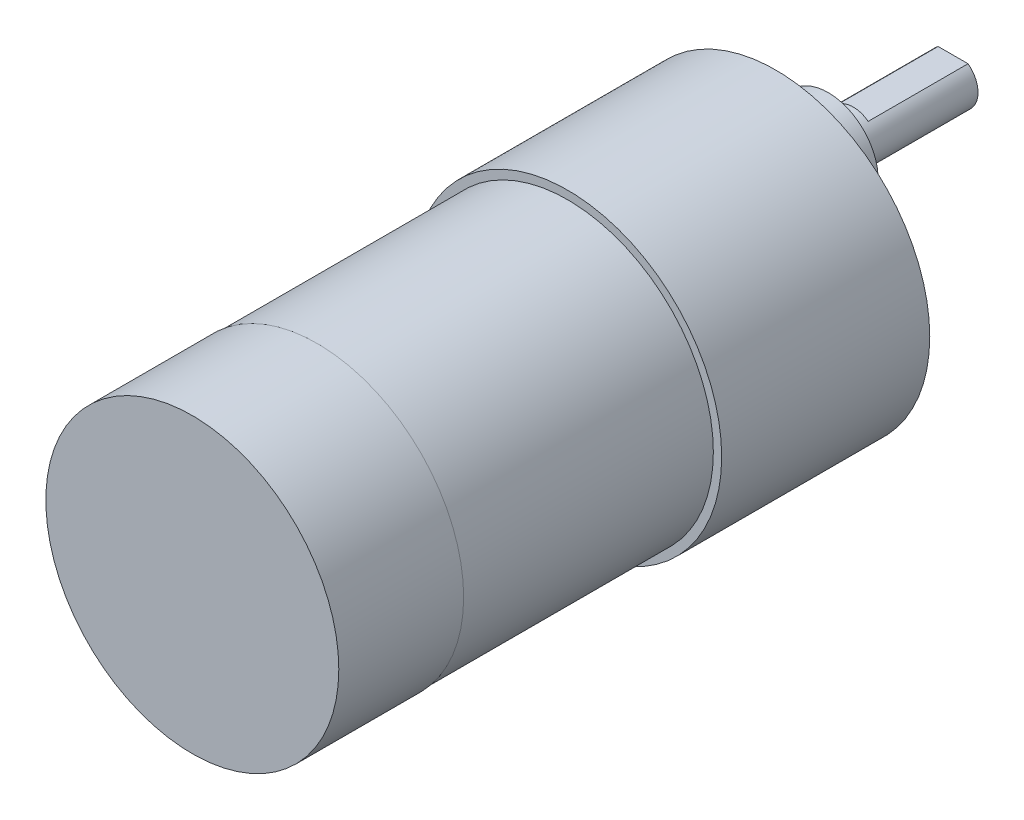
ISO-10303-21;
HEADER;
FILE_DESCRIPTION(('STEP AP214'),'2;1');
FILE_NAME('part.step','',(''),(''),'','','');
FILE_SCHEMA(('AUTOMOTIVE_DESIGN { 1 0 10303 214 1 1 1 1 }'));
ENDSEC;
DATA;
#1=APPLICATION_CONTEXT('core data for automotive mechanical design processes');
#2=APPLICATION_PROTOCOL_DEFINITION('international standard','automotive_design',2000,#1);
#3=PRODUCT_CONTEXT('',#1,'mechanical');
#4=PRODUCT('Part','Part','',(#3));
#5=PRODUCT_RELATED_PRODUCT_CATEGORY('part','',(#4));
#6=PRODUCT_DEFINITION_FORMATION('','',#4);
#7=PRODUCT_DEFINITION_CONTEXT('part definition',#1,'design');
#8=PRODUCT_DEFINITION('design','',#6,#7);
#9=PRODUCT_DEFINITION_SHAPE('','',#8);
#10=(LENGTH_UNIT() NAMED_UNIT(*) SI_UNIT(.MILLI.,.METRE.));
#11=(NAMED_UNIT(*) PLANE_ANGLE_UNIT() SI_UNIT($,.RADIAN.));
#12=(NAMED_UNIT(*) SI_UNIT($,.STERADIAN.) SOLID_ANGLE_UNIT());
#13=UNCERTAINTY_MEASURE_WITH_UNIT(LENGTH_MEASURE(1.E-05),#10,'distance_accuracy_value','');
#14=(GEOMETRIC_REPRESENTATION_CONTEXT(3) GLOBAL_UNCERTAINTY_ASSIGNED_CONTEXT((#13)) GLOBAL_UNIT_ASSIGNED_CONTEXT((#10,
#11,#12)) REPRESENTATION_CONTEXT('',''));
#15=CARTESIAN_POINT('',(0.,0.,0.));
#16=DIRECTION('',(0.,0.,1.));
#17=DIRECTION('',(1.,0.,0.));
#18=AXIS2_PLACEMENT_3D('',#15,#16,#17);
#19=CARTESIAN_POINT('',(-4.1286418728248E-13,-13.875,179.237955952687));
#20=DIRECTION('',(0.,0.,1.));
#21=DIRECTION('',(1.,0.,0.));
#22=AXIS2_PLACEMENT_3D('',#19,#20,#21);
#23=CYLINDRICAL_SURFACE('',#22,17.6000000000003);
#24=CARTESIAN_POINT('',(-4.1286418728248E-13,-13.875,179.237955952687));
#25=DIRECTION('',(0.,0.,1.));
#26=DIRECTION('',(1.,0.,0.));
#27=AXIS2_PLACEMENT_3D('',#24,#25,#26);
#28=CIRCLE('',#27,17.6000000000003);
#29=CARTESIAN_POINT('',(17.5999999999998,-13.875,179.237955952687));
#30=VERTEX_POINT('',#29);
#31=EDGE_CURVE('E12',#30,#30,#28,.T.);
#32=ORIENTED_EDGE('',*,*,#31,.T.);
#33=EDGE_LOOP('',(#32));
#34=FACE_BOUND('',#33,.T.);
#35=CARTESIAN_POINT('',(-4.1286418728248E-13,-13.875,194.237955952687));
#36=DIRECTION('',(0.,0.,1.));
#37=DIRECTION('',(1.,0.,0.));
#38=AXIS2_PLACEMENT_3D('',#35,#36,#37);
#39=CIRCLE('',#38,17.6000000000003);
#40=CARTESIAN_POINT('',(17.5999999999998,-13.875,194.237955952687));
#41=VERTEX_POINT('',#40);
#42=EDGE_CURVE('E45',#41,#41,#39,.T.);
#43=ORIENTED_EDGE('',*,*,#42,.F.);
#44=EDGE_LOOP('',(#43));
#45=FACE_BOUND('',#44,.T.);
#46=ADVANCED_FACE('F42',(#34,#45),#23,.T.);
#47=CARTESIAN_POINT('',(-4.1286418728248E-13,-13.875,179.237955952687));
#48=DIRECTION('',(0.,0.,1.));
#49=DIRECTION('',(1.,0.,0.));
#50=AXIS2_PLACEMENT_3D('',#47,#48,#49);
#51=PLANE('',#50);
#52=ORIENTED_EDGE('',*,*,#31,.F.);
#53=EDGE_LOOP('',(#52));
#54=FACE_BOUND('',#53,.T.);
#55=ADVANCED_FACE('F57',(#54),#51,.F.);
#56=CARTESIAN_POINT('',(-4.1286418728248E-13,-13.875,194.237955952687));
#57=DIRECTION('',(0.,0.,1.));
#58=DIRECTION('',(1.,0.,0.));
#59=AXIS2_PLACEMENT_3D('',#56,#57,#58);
#60=PLANE('',#59);
#61=ORIENTED_EDGE('',*,*,#42,.T.);
#62=EDGE_LOOP('',(#61));
#63=FACE_BOUND('',#62,.T.);
#64=ADVANCED_FACE('F54',(#63),#60,.T.);
#65=CLOSED_SHELL('',(#46,#55,#64));
#66=MANIFOLD_SOLID_BREP('B2',#65);
#67=CARTESIAN_POINT('',(-4.54497550705923E-13,-6.875,102.837955952687));
#68=DIRECTION('',(0.,0.,1.));
#69=DIRECTION('',(1.,0.,0.));
#70=AXIS2_PLACEMENT_3D('',#67,#68,#69);
#71=CYLINDRICAL_SURFACE('',#70,2.99999999999975);
#72=CARTESIAN_POINT('',(-4.54497550705923E-13,-6.875,117.837955952687));
#73=DIRECTION('',(0.,0.,-1.));
#74=DIRECTION('',(-1.,0.,0.));
#75=AXIS2_PLACEMENT_3D('',#72,#73,#74);
#76=CIRCLE('',#75,2.99999999999975);
#77=CARTESIAN_POINT('',(-3.0000000000002,-6.875,117.837955952687));
#78=VERTEX_POINT('',#77);
#79=EDGE_CURVE('E124',#78,#78,#76,.T.);
#80=ORIENTED_EDGE('',*,*,#79,.T.);
#81=EDGE_LOOP('',(#80));
#82=FACE_BOUND('',#81,.T.);
#83=DIRECTION('',(0.,0.,-1.));
#84=VECTOR('',#83,1.);
#85=CARTESIAN_POINT('',(-1.80000000000003,-4.475,114.837955952687));
#86=LINE('',#85,#84);
#87=CARTESIAN_POINT('',(-1.80000000000003,-4.475,114.837955952687));
#88=VERTEX_POINT('',#87);
#89=CARTESIAN_POINT('',(-1.80000000000003,-4.475,102.837955952687));
#90=VERTEX_POINT('',#89);
#91=EDGE_CURVE('E112',#88,#90,#86,.T.);
#92=ORIENTED_EDGE('',*,*,#91,.T.);
#93=CARTESIAN_POINT('',(-4.54497550705923E-13,-6.875,102.837955952687));
#94=DIRECTION('',(0.,0.,-1.));
#95=DIRECTION('',(-1.,0.,0.));
#96=AXIS2_PLACEMENT_3D('',#93,#94,#95);
#97=CIRCLE('',#96,2.99999999999975);
#98=CARTESIAN_POINT('',(1.79999999999913,-4.475,102.837955952687));
#99=VERTEX_POINT('',#98);
#100=EDGE_CURVE('E119',#99,#90,#97,.T.);
#101=ORIENTED_EDGE('',*,*,#100,.F.);
#102=DIRECTION('',(0.,0.,-1.));
#103=VECTOR('',#102,1.);
#104=CARTESIAN_POINT('',(1.79999999999913,-4.475,114.837955952687));
#105=LINE('',#104,#103);
#106=CARTESIAN_POINT('',(1.79999999999913,-4.475,114.837955952687));
#107=VERTEX_POINT('',#106);
#108=EDGE_CURVE('E99',#107,#99,#105,.T.);
#109=ORIENTED_EDGE('',*,*,#108,.F.);
#110=CARTESIAN_POINT('',(-4.54497550705923E-13,-6.875,114.837955952687));
#111=DIRECTION('',(0.,0.,-1.));
#112=DIRECTION('',(-1.,0.,0.));
#113=AXIS2_PLACEMENT_3D('',#110,#111,#112);
#114=CIRCLE('',#113,2.99999999999975);
#115=EDGE_CURVE('E120',#88,#107,#114,.T.);
#116=ORIENTED_EDGE('',*,*,#115,.F.);
#117=EDGE_LOOP('',(#92,#101,#109,#116));
#118=FACE_BOUND('',#117,.T.);
#119=ADVANCED_FACE('F83',(#82,#118),#71,.T.);
#120=CARTESIAN_POINT('',(-4.54497550705923E-13,-6.875,102.837955952687));
#121=DIRECTION('',(0.,0.,-1.));
#122=DIRECTION('',(-1.,0.,0.));
#123=AXIS2_PLACEMENT_3D('',#120,#121,#122);
#124=PLANE('',#123);
#125=ORIENTED_EDGE('',*,*,#100,.T.);
#126=DIRECTION('',(1.,0.,0.));
#127=VECTOR('',#126,1.);
#128=CARTESIAN_POINT('',(0.,-4.475,102.837955952687));
#129=LINE('',#128,#127);
#130=EDGE_CURVE('E109',#90,#99,#129,.T.);
#131=ORIENTED_EDGE('',*,*,#130,.T.);
#132=EDGE_LOOP('',(#125,#131));
#133=FACE_BOUND('',#132,.T.);
#134=ADVANCED_FACE('F122',(#133),#124,.T.);
#135=CARTESIAN_POINT('',(-4.1286418728248E-13,-13.875,194.137955952687));
#136=DIRECTION('',(0.,0.,-1.));
#137=DIRECTION('',(-1.,0.,0.));
#138=AXIS2_PLACEMENT_3D('',#135,#136,#137);
#139=CYLINDRICAL_SURFACE('',#138,18.5);
#140=CARTESIAN_POINT('',(-4.1286418728248E-13,-13.875,124.137955952687));
#141=DIRECTION('',(0.,0.,-1.));
#142=DIRECTION('',(-1.,0.,0.));
#143=AXIS2_PLACEMENT_3D('',#140,#141,#142);
#144=CIRCLE('',#143,18.5);
#145=CARTESIAN_POINT('',(-18.5000000000004,-13.875,124.137955952687));
#146=VERTEX_POINT('',#145);
#147=EDGE_CURVE('E40',#146,#146,#144,.T.);
#148=ORIENTED_EDGE('',*,*,#147,.F.);
#149=EDGE_LOOP('',(#148));
#150=FACE_BOUND('',#149,.T.);
#151=CARTESIAN_POINT('',(-4.1286418728248E-13,-13.875,149.137955952687));
#152=DIRECTION('',(0.,0.,1.));
#153=DIRECTION('',(1.,0.,0.));
#154=AXIS2_PLACEMENT_3D('',#151,#152,#153);
#155=CIRCLE('',#154,18.5);
#156=CARTESIAN_POINT('',(18.4999999999995,-13.875,149.137955952687));
#157=VERTEX_POINT('',#156);
#158=EDGE_CURVE('E87',#157,#157,#155,.F.);
#159=ORIENTED_EDGE('',*,*,#158,.T.);
#160=EDGE_LOOP('',(#159));
#161=FACE_BOUND('',#160,.T.);
#162=ADVANCED_FACE('F85',(#150,#161),#139,.T.);
#163=CARTESIAN_POINT('',(-4.1286418728248E-13,-13.875,124.137955952687));
#164=DIRECTION('',(0.,0.,-1.));
#165=DIRECTION('',(-1.,0.,0.));
#166=AXIS2_PLACEMENT_3D('',#163,#164,#165);
#167=PLANE('',#166);
#168=CARTESIAN_POINT('',(15.4999999999996,-13.875,124.137955952687));
#169=DIRECTION('',(0.,0.,-1.));
#170=DIRECTION('',(-1.,0.,0.));
#171=AXIS2_PLACEMENT_3D('',#168,#169,#170);
#172=CIRCLE('',#171,1.49999999999975);
#173=CARTESIAN_POINT('',(13.9999999999998,-13.875,124.137955952687));
#174=VERTEX_POINT('',#173);
#175=EDGE_CURVE('E157',#174,#174,#172,.T.);
#176=ORIENTED_EDGE('',*,*,#175,.F.);
#177=EDGE_LOOP('',(#176));
#178=FACE_BOUND('',#177,.T.);
#179=CARTESIAN_POINT('',(7.74999999999959,-27.2983937586588,124.137955952687));
#180=DIRECTION('',(0.,0.,-1.));
#181=DIRECTION('',(-1.,0.,0.));
#182=AXIS2_PLACEMENT_3D('',#179,#180,#181);
#183=CIRCLE('',#182,1.49999999999975);
#184=CARTESIAN_POINT('',(6.24999999999984,-27.2983937586588,124.137955952687));
#185=VERTEX_POINT('',#184);
#186=EDGE_CURVE('E181',#185,#185,#183,.T.);
#187=ORIENTED_EDGE('',*,*,#186,.F.);
#188=EDGE_LOOP('',(#187));
#189=FACE_BOUND('',#188,.T.);
#190=CARTESIAN_POINT('',(-7.75000000000042,-27.2983937586588,124.137955952687));
#191=DIRECTION('',(0.,0.,-1.));
#192=DIRECTION('',(-1.,0.,0.));
#193=AXIS2_PLACEMENT_3D('',#190,#191,#192);
#194=CIRCLE('',#193,1.49999999999975);
#195=CARTESIAN_POINT('',(-9.25000000000017,-27.2983937586588,124.137955952687));
#196=VERTEX_POINT('',#195);
#197=EDGE_CURVE('E175',#196,#196,#194,.T.);
#198=ORIENTED_EDGE('',*,*,#197,.F.);
#199=EDGE_LOOP('',(#198));
#200=FACE_BOUND('',#199,.T.);
#201=CARTESIAN_POINT('',(-15.5000000000004,-13.875,124.137955952687));
#202=DIRECTION('',(0.,0.,-1.));
#203=DIRECTION('',(-1.,0.,0.));
#204=AXIS2_PLACEMENT_3D('',#201,#202,#203);
#205=CIRCLE('',#204,1.49999999999975);
#206=CARTESIAN_POINT('',(-17.0000000000002,-13.875,124.137955952687));
#207=VERTEX_POINT('',#206);
#208=EDGE_CURVE('E174',#207,#207,#205,.T.);
#209=ORIENTED_EDGE('',*,*,#208,.F.);
#210=EDGE_LOOP('',(#209));
#211=FACE_BOUND('',#210,.T.);
#212=CARTESIAN_POINT('',(-7.75000000000041,-0.451606241341201,124.137955952687));
#213=DIRECTION('',(0.,0.,-1.));
#214=DIRECTION('',(-1.,0.,0.));
#215=AXIS2_PLACEMENT_3D('',#212,#213,#214);
#216=CIRCLE('',#215,1.49999999999975);
#217=CARTESIAN_POINT('',(-9.25000000000016,-0.451606241341201,124.137955952687));
#218=VERTEX_POINT('',#217);
#219=EDGE_CURVE('E189',#218,#218,#216,.T.);
#220=ORIENTED_EDGE('',*,*,#219,.F.);
#221=EDGE_LOOP('',(#220));
#222=FACE_BOUND('',#221,.T.);
#223=CARTESIAN_POINT('',(7.74999999999959,-0.451606241341208,124.137955952687));
#224=DIRECTION('',(0.,0.,-1.));
#225=DIRECTION('',(-1.,0.,0.));
#226=AXIS2_PLACEMENT_3D('',#223,#224,#225);
#227=CIRCLE('',#226,1.49999999999975);
#228=CARTESIAN_POINT('',(6.24999999999984,-0.451606241341208,124.137955952687));
#229=VERTEX_POINT('',#228);
#230=EDGE_CURVE('E132',#229,#229,#227,.T.);
#231=ORIENTED_EDGE('',*,*,#230,.F.);
#232=EDGE_LOOP('',(#231));
#233=FACE_BOUND('',#232,.T.);
#234=CARTESIAN_POINT('',(-4.54497550705923E-13,-6.875,124.137955952687));
#235=DIRECTION('',(0.,0.,-1.));
#236=DIRECTION('',(-1.,0.,0.));
#237=AXIS2_PLACEMENT_3D('',#234,#235,#236);
#238=CIRCLE('',#237,5.99999999999975);
#239=CARTESIAN_POINT('',(-6.00000000000021,-6.875,124.137955952687));
#240=VERTEX_POINT('',#239);
#241=EDGE_CURVE('E123',#240,#240,#238,.T.);
#242=ORIENTED_EDGE('',*,*,#241,.F.);
#243=EDGE_LOOP('',(#242));
#244=FACE_BOUND('',#243,.T.);
#245=ORIENTED_EDGE('',*,*,#147,.T.);
#246=EDGE_LOOP('',(#245));
#247=FACE_BOUND('',#246,.T.);
#248=ADVANCED_FACE('F143',(#178,#189,#200,#211,#222,#233,#244,#247),#167,.T.);
#249=CARTESIAN_POINT('',(-4.54497550705923E-13,-6.875,117.837955952687));
#250=DIRECTION('',(0.,0.,1.));
#251=DIRECTION('',(1.,0.,0.));
#252=AXIS2_PLACEMENT_3D('',#249,#250,#251);
#253=CYLINDRICAL_SURFACE('',#252,5.99999999999975);
#254=CARTESIAN_POINT('',(-4.54497550705923E-13,-6.875,117.837955952687));
#255=DIRECTION('',(0.,0.,-1.));
#256=DIRECTION('',(-1.,0.,0.));
#257=AXIS2_PLACEMENT_3D('',#254,#255,#256);
#258=CIRCLE('',#257,5.99999999999975);
#259=CARTESIAN_POINT('',(-6.00000000000021,-6.875,117.837955952687));
#260=VERTEX_POINT('',#259);
#261=EDGE_CURVE('E92',#260,#260,#258,.T.);
#262=ORIENTED_EDGE('',*,*,#261,.F.);
#263=EDGE_LOOP('',(#262));
#264=FACE_BOUND('',#263,.T.);
#265=ORIENTED_EDGE('',*,*,#241,.T.);
#266=EDGE_LOOP('',(#265));
#267=FACE_BOUND('',#266,.T.);
#268=ADVANCED_FACE('F140',(#264,#267),#253,.T.);
#269=CARTESIAN_POINT('',(-4.54497550705923E-13,-6.875,117.837955952687));
#270=DIRECTION('',(0.,0.,-1.));
#271=DIRECTION('',(-1.,0.,0.));
#272=AXIS2_PLACEMENT_3D('',#269,#270,#271);
#273=PLANE('',#272);
#274=ORIENTED_EDGE('',*,*,#79,.F.);
#275=EDGE_LOOP('',(#274));
#276=FACE_BOUND('',#275,.T.);
#277=ORIENTED_EDGE('',*,*,#261,.T.);
#278=EDGE_LOOP('',(#277));
#279=FACE_BOUND('',#278,.T.);
#280=ADVANCED_FACE('F138',(#276,#279),#273,.T.);
#281=CARTESIAN_POINT('',(7.74999999999959,-0.451606241341208,144.137955952687));
#282=DIRECTION('',(0.,0.,-1.));
#283=DIRECTION('',(-1.,0.,0.));
#284=AXIS2_PLACEMENT_3D('',#281,#282,#283);
#285=CYLINDRICAL_SURFACE('',#284,1.49999999999975);
#286=CARTESIAN_POINT('',(7.74999999999959,-0.451606241341208,144.137955952687));
#287=DIRECTION('',(0.,0.,-1.));
#288=DIRECTION('',(-1.,0.,0.));
#289=AXIS2_PLACEMENT_3D('',#286,#287,#288);
#290=CIRCLE('',#289,1.49999999999975);
#291=CARTESIAN_POINT('',(6.24999999999984,-0.451606241341208,144.137955952687));
#292=VERTEX_POINT('',#291);
#293=EDGE_CURVE('E129',#292,#292,#290,.T.);
#294=ORIENTED_EDGE('',*,*,#293,.F.);
#295=EDGE_LOOP('',(#294));
#296=FACE_BOUND('',#295,.T.);
#297=ORIENTED_EDGE('',*,*,#230,.T.);
#298=EDGE_LOOP('',(#297));
#299=FACE_BOUND('',#298,.T.);
#300=ADVANCED_FACE('F202',(#296,#299),#285,.F.);
#301=CARTESIAN_POINT('',(7.74999999999959,-0.451606241341208,144.137955952687));
#302=DIRECTION('',(0.,0.,-1.));
#303=DIRECTION('',(-1.,0.,0.));
#304=AXIS2_PLACEMENT_3D('',#301,#302,#303);
#305=PLANE('',#304);
#306=ORIENTED_EDGE('',*,*,#293,.T.);
#307=EDGE_LOOP('',(#306));
#308=FACE_BOUND('',#307,.T.);
#309=ADVANCED_FACE('F205',(#308),#305,.T.);
#310=CARTESIAN_POINT('',(-7.75000000000041,-0.451606241341201,144.137955952687));
#311=DIRECTION('',(0.,0.,-1.));
#312=DIRECTION('',(-1.,0.,0.));
#313=AXIS2_PLACEMENT_3D('',#310,#311,#312);
#314=CYLINDRICAL_SURFACE('',#313,1.49999999999975);
#315=CARTESIAN_POINT('',(-7.75000000000041,-0.451606241341201,144.137955952687));
#316=DIRECTION('',(0.,0.,-1.));
#317=DIRECTION('',(-1.,0.,0.));
#318=AXIS2_PLACEMENT_3D('',#315,#316,#317);
#319=CIRCLE('',#318,1.49999999999975);
#320=CARTESIAN_POINT('',(-9.25000000000016,-0.451606241341201,144.137955952687));
#321=VERTEX_POINT('',#320);
#322=EDGE_CURVE('E186',#321,#321,#319,.T.);
#323=ORIENTED_EDGE('',*,*,#322,.F.);
#324=EDGE_LOOP('',(#323));
#325=FACE_BOUND('',#324,.T.);
#326=ORIENTED_EDGE('',*,*,#219,.T.);
#327=EDGE_LOOP('',(#326));
#328=FACE_BOUND('',#327,.T.);
#329=ADVANCED_FACE('F212',(#325,#328),#314,.F.);
#330=CARTESIAN_POINT('',(-7.75000000000041,-0.451606241341201,144.137955952687));
#331=DIRECTION('',(0.,0.,-1.));
#332=DIRECTION('',(-1.,0.,0.));
#333=AXIS2_PLACEMENT_3D('',#330,#331,#332);
#334=PLANE('',#333);
#335=ORIENTED_EDGE('',*,*,#322,.T.);
#336=EDGE_LOOP('',(#335));
#337=FACE_BOUND('',#336,.T.);
#338=ADVANCED_FACE('F269',(#337),#334,.T.);
#339=CARTESIAN_POINT('',(-15.5000000000004,-13.875,144.137955952687));
#340=DIRECTION('',(0.,0.,-1.));
#341=DIRECTION('',(-1.,0.,0.));
#342=AXIS2_PLACEMENT_3D('',#339,#340,#341);
#343=CYLINDRICAL_SURFACE('',#342,1.49999999999975);
#344=CARTESIAN_POINT('',(-15.5000000000004,-13.875,144.137955952687));
#345=DIRECTION('',(0.,0.,-1.));
#346=DIRECTION('',(-1.,0.,0.));
#347=AXIS2_PLACEMENT_3D('',#344,#345,#346);
#348=CIRCLE('',#347,1.49999999999975);
#349=CARTESIAN_POINT('',(-17.0000000000002,-13.875,144.137955952687));
#350=VERTEX_POINT('',#349);
#351=EDGE_CURVE('E192',#350,#350,#348,.T.);
#352=ORIENTED_EDGE('',*,*,#351,.F.);
#353=EDGE_LOOP('',(#352));
#354=FACE_BOUND('',#353,.T.);
#355=ORIENTED_EDGE('',*,*,#208,.T.);
#356=EDGE_LOOP('',(#355));
#357=FACE_BOUND('',#356,.T.);
#358=ADVANCED_FACE('F272',(#354,#357),#343,.F.);
#359=CARTESIAN_POINT('',(-15.5000000000004,-13.875,144.137955952687));
#360=DIRECTION('',(0.,0.,-1.));
#361=DIRECTION('',(-1.,0.,0.));
#362=AXIS2_PLACEMENT_3D('',#359,#360,#361);
#363=PLANE('',#362);
#364=ORIENTED_EDGE('',*,*,#351,.T.);
#365=EDGE_LOOP('',(#364));
#366=FACE_BOUND('',#365,.T.);
#367=ADVANCED_FACE('F253',(#366),#363,.T.);
#368=CARTESIAN_POINT('',(-7.75000000000042,-27.2983937586588,144.137955952687));
#369=DIRECTION('',(0.,0.,-1.));
#370=DIRECTION('',(-1.,0.,0.));
#371=AXIS2_PLACEMENT_3D('',#368,#369,#370);
#372=CYLINDRICAL_SURFACE('',#371,1.49999999999975);
#373=CARTESIAN_POINT('',(-7.75000000000042,-27.2983937586588,144.137955952687));
#374=DIRECTION('',(0.,0.,-1.));
#375=DIRECTION('',(-1.,0.,0.));
#376=AXIS2_PLACEMENT_3D('',#373,#374,#375);
#377=CIRCLE('',#376,1.49999999999975);
#378=CARTESIAN_POINT('',(-9.25000000000017,-27.2983937586588,144.137955952687));
#379=VERTEX_POINT('',#378);
#380=EDGE_CURVE('E171',#379,#379,#377,.T.);
#381=ORIENTED_EDGE('',*,*,#380,.F.);
#382=EDGE_LOOP('',(#381));
#383=FACE_BOUND('',#382,.T.);
#384=ORIENTED_EDGE('',*,*,#197,.T.);
#385=EDGE_LOOP('',(#384));
#386=FACE_BOUND('',#385,.T.);
#387=ADVANCED_FACE('F249',(#383,#386),#372,.F.);
#388=CARTESIAN_POINT('',(-7.75000000000042,-27.2983937586588,144.137955952687));
#389=DIRECTION('',(0.,0.,-1.));
#390=DIRECTION('',(-1.,0.,0.));
#391=AXIS2_PLACEMENT_3D('',#388,#389,#390);
#392=PLANE('',#391);
#393=ORIENTED_EDGE('',*,*,#380,.T.);
#394=EDGE_LOOP('',(#393));
#395=FACE_BOUND('',#394,.T.);
#396=ADVANCED_FACE('F245',(#395),#392,.T.);
#397=CARTESIAN_POINT('',(7.74999999999959,-27.2983937586588,144.137955952687));
#398=DIRECTION('',(0.,0.,-1.));
#399=DIRECTION('',(-1.,0.,0.));
#400=AXIS2_PLACEMENT_3D('',#397,#398,#399);
#401=CYLINDRICAL_SURFACE('',#400,1.49999999999975);
#402=CARTESIAN_POINT('',(7.74999999999959,-27.2983937586588,144.137955952687));
#403=DIRECTION('',(0.,0.,-1.));
#404=DIRECTION('',(-1.,0.,0.));
#405=AXIS2_PLACEMENT_3D('',#402,#403,#404);
#406=CIRCLE('',#405,1.49999999999975);
#407=CARTESIAN_POINT('',(6.24999999999984,-27.2983937586588,144.137955952687));
#408=VERTEX_POINT('',#407);
#409=EDGE_CURVE('E178',#408,#408,#406,.T.);
#410=ORIENTED_EDGE('',*,*,#409,.F.);
#411=EDGE_LOOP('',(#410));
#412=FACE_BOUND('',#411,.T.);
#413=ORIENTED_EDGE('',*,*,#186,.T.);
#414=EDGE_LOOP('',(#413));
#415=FACE_BOUND('',#414,.T.);
#416=ADVANCED_FACE('F248',(#412,#415),#401,.F.);
#417=CARTESIAN_POINT('',(7.74999999999959,-27.2983937586588,144.137955952687));
#418=DIRECTION('',(0.,0.,-1.));
#419=DIRECTION('',(-1.,0.,0.));
#420=AXIS2_PLACEMENT_3D('',#417,#418,#419);
#421=PLANE('',#420);
#422=ORIENTED_EDGE('',*,*,#409,.T.);
#423=EDGE_LOOP('',(#422));
#424=FACE_BOUND('',#423,.T.);
#425=ADVANCED_FACE('F255',(#424),#421,.T.);
#426=CARTESIAN_POINT('',(15.4999999999996,-13.875,144.137955952687));
#427=DIRECTION('',(0.,0.,-1.));
#428=DIRECTION('',(-1.,0.,0.));
#429=AXIS2_PLACEMENT_3D('',#426,#427,#428);
#430=CYLINDRICAL_SURFACE('',#429,1.49999999999975);
#431=CARTESIAN_POINT('',(15.4999999999996,-13.875,144.137955952687));
#432=DIRECTION('',(0.,0.,-1.));
#433=DIRECTION('',(-1.,0.,0.));
#434=AXIS2_PLACEMENT_3D('',#431,#432,#433);
#435=CIRCLE('',#434,1.49999999999975);
#436=CARTESIAN_POINT('',(13.9999999999998,-13.875,144.137955952687));
#437=VERTEX_POINT('',#436);
#438=EDGE_CURVE('E160',#437,#437,#435,.T.);
#439=ORIENTED_EDGE('',*,*,#438,.F.);
#440=EDGE_LOOP('',(#439));
#441=FACE_BOUND('',#440,.T.);
#442=ORIENTED_EDGE('',*,*,#175,.T.);
#443=EDGE_LOOP('',(#442));
#444=FACE_BOUND('',#443,.T.);
#445=ADVANCED_FACE('F258',(#441,#444),#430,.F.);
#446=CARTESIAN_POINT('',(15.4999999999996,-13.875,144.137955952687));
#447=DIRECTION('',(0.,0.,-1.));
#448=DIRECTION('',(-1.,0.,0.));
#449=AXIS2_PLACEMENT_3D('',#446,#447,#448);
#450=PLANE('',#449);
#451=ORIENTED_EDGE('',*,*,#438,.T.);
#452=EDGE_LOOP('',(#451));
#453=FACE_BOUND('',#452,.T.);
#454=ADVANCED_FACE('F241',(#453),#450,.T.);
#455=CARTESIAN_POINT('',(-4.1286418728248E-13,-13.875,149.137955952687));
#456=DIRECTION('',(0.,0.,1.));
#457=DIRECTION('',(1.,0.,0.));
#458=AXIS2_PLACEMENT_3D('',#455,#456,#457);
#459=PLANE('',#458);
#460=ORIENTED_EDGE('',*,*,#158,.F.);
#461=EDGE_LOOP('',(#460));
#462=FACE_BOUND('',#461,.T.);
#463=CARTESIAN_POINT('',(-4.1286418728248E-13,-13.875,149.137955952687));
#464=DIRECTION('',(0.,0.,1.));
#465=DIRECTION('',(1.,0.,0.));
#466=AXIS2_PLACEMENT_3D('',#463,#464,#465);
#467=CIRCLE('',#466,17.5000000000003);
#468=CARTESIAN_POINT('',(17.4999999999998,-13.875,149.137955952687));
#469=VERTEX_POINT('',#468);
#470=EDGE_CURVE('E158',#469,#469,#467,.T.);
#471=ORIENTED_EDGE('',*,*,#470,.F.);
#472=EDGE_LOOP('',(#471));
#473=FACE_BOUND('',#472,.T.);
#474=ADVANCED_FACE('F234',(#462,#473),#459,.T.);
#475=CARTESIAN_POINT('',(-4.1286418728248E-13,-13.875,149.137955952687));
#476=DIRECTION('',(0.,0.,1.));
#477=DIRECTION('',(1.,0.,0.));
#478=AXIS2_PLACEMENT_3D('',#475,#476,#477);
#479=CYLINDRICAL_SURFACE('',#478,17.5000000000003);
#480=CARTESIAN_POINT('',(-4.1286418728248E-13,-13.875,194.137955952687));
#481=DIRECTION('',(0.,0.,1.));
#482=DIRECTION('',(1.,0.,0.));
#483=AXIS2_PLACEMENT_3D('',#480,#481,#482);
#484=CIRCLE('',#483,17.5000000000003);
#485=CARTESIAN_POINT('',(17.4999999999998,-13.875,194.137955952687));
#486=VERTEX_POINT('',#485);
#487=EDGE_CURVE('E163',#486,#486,#484,.T.);
#488=CARTESIAN_POINT('',(17.4999999999998,-13.875,149.137955952687));
#489=CARTESIAN_POINT('',(17.4999999999998,-13.875,149.606705952687));
#490=CARTESIAN_POINT('',(17.4999999999998,-13.875,150.075455952687));
#491=CARTESIAN_POINT('',(17.4999999999998,-13.875,151.012955952687));
#492=CARTESIAN_POINT('',(17.4999999999998,-13.875,151.481705952687));
#493=CARTESIAN_POINT('',(17.4999999999998,-13.875,152.419205952687));
#494=CARTESIAN_POINT('',(17.4999999999998,-13.875,152.887955952687));
#495=CARTESIAN_POINT('',(17.4999999999998,-13.875,153.825455952687));
#496=CARTESIAN_POINT('',(17.4999999999998,-13.875,154.294205952687));
#497=CARTESIAN_POINT('',(17.4999999999998,-13.875,155.231705952687));
#498=CARTESIAN_POINT('',(17.4999999999998,-13.875,155.700455952687));
#499=CARTESIAN_POINT('',(17.4999999999998,-13.875,156.637955952687));
#500=CARTESIAN_POINT('',(17.4999999999998,-13.875,157.106705952687));
#501=CARTESIAN_POINT('',(17.4999999999998,-13.875,158.044205952687));
#502=CARTESIAN_POINT('',(17.4999999999998,-13.875,158.512955952687));
#503=CARTESIAN_POINT('',(17.4999999999998,-13.875,159.450455952687));
#504=CARTESIAN_POINT('',(17.4999999999998,-13.875,159.919205952687));
#505=CARTESIAN_POINT('',(17.4999999999998,-13.875,160.856705952687));
#506=CARTESIAN_POINT('',(17.4999999999998,-13.875,161.325455952687));
#507=CARTESIAN_POINT('',(17.4999999999998,-13.875,162.262955952687));
#508=CARTESIAN_POINT('',(17.4999999999998,-13.875,162.731705952687));
#509=CARTESIAN_POINT('',(17.4999999999998,-13.875,163.669205952687));
#510=CARTESIAN_POINT('',(17.4999999999998,-13.875,164.137955952687));
#511=CARTESIAN_POINT('',(17.4999999999998,-13.875,165.075455952687));
#512=CARTESIAN_POINT('',(17.4999999999998,-13.875,165.544205952687));
#513=CARTESIAN_POINT('',(17.4999999999998,-13.875,166.481705952687));
#514=CARTESIAN_POINT('',(17.4999999999998,-13.875,166.950455952687));
#515=CARTESIAN_POINT('',(17.4999999999998,-13.875,167.887955952687));
#516=CARTESIAN_POINT('',(17.4999999999998,-13.875,168.356705952687));
#517=CARTESIAN_POINT('',(17.4999999999998,-13.875,169.294205952687));
#518=CARTESIAN_POINT('',(17.4999999999998,-13.875,169.762955952687));
#519=CARTESIAN_POINT('',(17.4999999999998,-13.875,170.700455952687));
#520=CARTESIAN_POINT('',(17.4999999999998,-13.875,171.169205952687));
#521=CARTESIAN_POINT('',(17.4999999999998,-13.875,172.106705952687));
#522=CARTESIAN_POINT('',(17.4999999999998,-13.875,172.575455952687));
#523=CARTESIAN_POINT('',(17.4999999999998,-13.875,173.512955952687));
#524=CARTESIAN_POINT('',(17.4999999999998,-13.875,173.981705952687));
#525=CARTESIAN_POINT('',(17.4999999999998,-13.875,174.919205952687));
#526=CARTESIAN_POINT('',(17.4999999999998,-13.875,175.387955952687));
#527=CARTESIAN_POINT('',(17.4999999999998,-13.875,176.325455952687));
#528=CARTESIAN_POINT('',(17.4999999999998,-13.875,176.794205952687));
#529=CARTESIAN_POINT('',(17.4999999999998,-13.875,177.731705952687));
#530=CARTESIAN_POINT('',(17.4999999999998,-13.875,178.200455952687));
#531=CARTESIAN_POINT('',(17.4999999999998,-13.875,179.137955952687));
#532=CARTESIAN_POINT('',(17.4999999999998,-13.875,179.606705952687));
#533=CARTESIAN_POINT('',(17.4999999999998,-13.875,180.544205952687));
#534=CARTESIAN_POINT('',(17.4999999999998,-13.875,181.012955952687));
#535=CARTESIAN_POINT('',(17.4999999999998,-13.875,181.950455952687));
#536=CARTESIAN_POINT('',(17.4999999999998,-13.875,182.419205952687));
#537=CARTESIAN_POINT('',(17.4999999999998,-13.875,183.356705952687));
#538=CARTESIAN_POINT('',(17.4999999999998,-13.875,183.825455952687));
#539=CARTESIAN_POINT('',(17.4999999999998,-13.875,184.762955952687));
#540=CARTESIAN_POINT('',(17.4999999999998,-13.875,185.231705952687));
#541=CARTESIAN_POINT('',(17.4999999999998,-13.875,186.169205952687));
#542=CARTESIAN_POINT('',(17.4999999999998,-13.875,186.637955952687));
#543=CARTESIAN_POINT('',(17.4999999999998,-13.875,187.575455952687));
#544=CARTESIAN_POINT('',(17.4999999999998,-13.875,188.044205952687));
#545=CARTESIAN_POINT('',(17.4999999999998,-13.875,188.981705952687));
#546=CARTESIAN_POINT('',(17.4999999999998,-13.875,189.450455952687));
#547=CARTESIAN_POINT('',(17.4999999999998,-13.875,190.387955952687));
#548=CARTESIAN_POINT('',(17.4999999999998,-13.875,190.856705952687));
#549=CARTESIAN_POINT('',(17.4999999999998,-13.875,191.794205952687));
#550=CARTESIAN_POINT('',(17.4999999999998,-13.875,192.262955952687));
#551=CARTESIAN_POINT('',(17.4999999999998,-13.875,193.200455952687));
#552=CARTESIAN_POINT('',(17.4999999999998,-13.875,193.669205952687));
#553=CARTESIAN_POINT('',(17.4999999999998,-13.875,194.137955952687));
#554=B_SPLINE_CURVE_WITH_KNOTS('',3,(#488,#489,#490,#491,#492,#493,#494,#495,#496,#497,#498,
#499,#500,#501,#502,#503,#504,#505,#506,#507,#508,#509,#510,#511,#512,#513,#514,#515,#516,#517,
#518,#519,#520,#521,#522,#523,#524,#525,#526,#527,#528,#529,#530,#531,#532,#533,#534,#535,#536,
#537,#538,#539,#540,#541,#542,#543,#544,#545,#546,#547,#548,#549,#550,#551,#552,#553),
.UNSPECIFIED.,.F.,.F.,(4,2,2,2,2,2,2,2,2,2,2,2,2,2,2,2,2,2,2,2,2,2,2,2,2,2,2,2,2,2,2,2,4),(0.,
1.40625000000003,2.81250000000002,4.21875000000002,5.62500000000002,7.03125000000002,
8.43750000000001,9.84375000000001,11.25,12.65625,14.0625,15.46875,16.875,18.28125,19.6875,
21.09375,22.5,23.90625,25.3125,26.71875,28.125,29.53125,30.9375,32.34375,33.75,35.15625,36.5625,
37.96875,39.375,40.78125,42.1875,43.59375,45.),.UNSPECIFIED.);
#555=EDGE_CURVE('BSEAM226',#469,#486,#554,.T.);
#556=ORIENTED_EDGE('',*,*,#470,.T.);
#557=ORIENTED_EDGE('',*,*,#487,.F.);
#558=ORIENTED_EDGE('',*,*,#555,.T.);
#559=ORIENTED_EDGE('',*,*,#555,.F.);
#560=EDGE_LOOP('',(#556,#558,#557,#559));
#561=FACE_BOUND('',#560,.T.);
#562=ADVANCED_FACE('F226',(#561),#479,.T.);
#563=CARTESIAN_POINT('',(-4.1286418728248E-13,-13.875,194.137955952687));
#564=DIRECTION('',(0.,0.,-1.));
#565=DIRECTION('',(-1.,0.,0.));
#566=AXIS2_PLACEMENT_3D('',#563,#564,#565);
#567=PLANE('',#566);
#568=ORIENTED_EDGE('',*,*,#487,.T.);
#569=EDGE_LOOP('',(#568));
#570=FACE_BOUND('',#569,.T.);
#571=ADVANCED_FACE('F224',(#570),#567,.F.);
#572=CARTESIAN_POINT('',(0.,-4.475,114.837955952687));
#573=DIRECTION('',(0.,1.,0.));
#574=DIRECTION('',(-1.,0.,0.));
#575=AXIS2_PLACEMENT_3D('',#572,#573,#574);
#576=PLANE('',#575);
#577=ORIENTED_EDGE('',*,*,#130,.F.);
#578=ORIENTED_EDGE('',*,*,#91,.F.);
#579=DIRECTION('',(1.,0.,0.));
#580=VECTOR('',#579,1.);
#581=CARTESIAN_POINT('',(0.,-4.475,114.837955952687));
#582=LINE('',#581,#580);
#583=EDGE_CURVE('E105',#88,#107,#582,.T.);
#584=ORIENTED_EDGE('',*,*,#583,.T.);
#585=ORIENTED_EDGE('',*,*,#108,.T.);
#586=EDGE_LOOP('',(#577,#578,#584,#585));
#587=FACE_BOUND('',#586,.T.);
#588=ADVANCED_FACE('F111',(#587),#576,.T.);
#589=CARTESIAN_POINT('',(0.,0.,114.837955952687));
#590=DIRECTION('',(0.,0.,-1.));
#591=DIRECTION('',(-1.,0.,0.));
#592=AXIS2_PLACEMENT_3D('',#589,#590,#591);
#593=PLANE('',#592);
#594=ORIENTED_EDGE('',*,*,#583,.F.);
#595=ORIENTED_EDGE('',*,*,#115,.T.);
#596=EDGE_LOOP('',(#594,#595));
#597=FACE_BOUND('',#596,.T.);
#598=ADVANCED_FACE('F232',(#597),#593,.T.);
#599=CLOSED_SHELL('',(#119,#134,#162,#248,#268,#280,#300,#309,#329,#338,#358,#367,#387,#396,
#416,#425,#445,#454,#474,#562,#571,#588,#598));
#600=MANIFOLD_SOLID_BREP('B7',#599);
#601=ADVANCED_BREP_SHAPE_REPRESENTATION('',(#18,#66,#600),#14);
#602=SHAPE_DEFINITION_REPRESENTATION(#9,#601);
ENDSEC;
END-ISO-10303-21;
